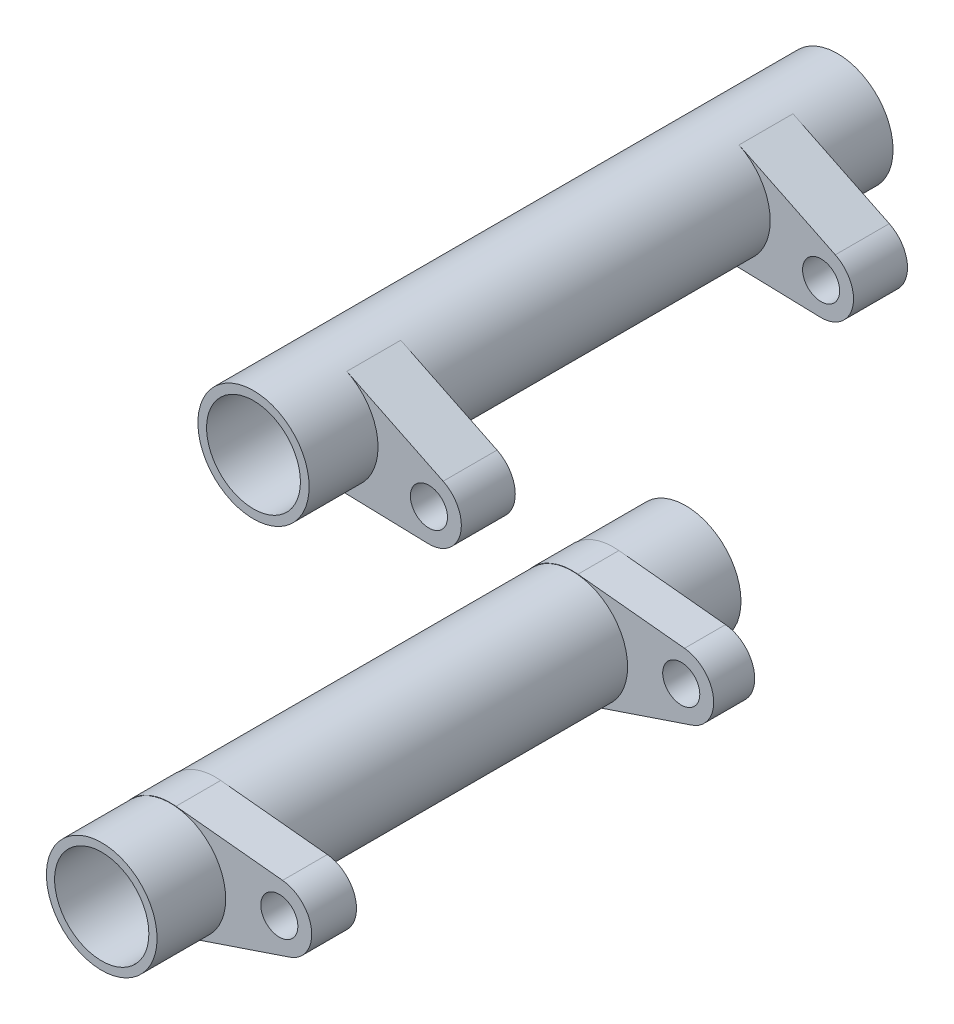
ISO-10303-21;
HEADER;
FILE_DESCRIPTION(('STEP AP214'),'2;1');
FILE_NAME('part.step','',(''),(''),'','','');
FILE_SCHEMA(('AUTOMOTIVE_DESIGN { 1 0 10303 214 1 1 1 1 }'));
ENDSEC;
DATA;
#1=APPLICATION_CONTEXT('core data for automotive mechanical design processes');
#2=APPLICATION_PROTOCOL_DEFINITION('international standard','automotive_design',2000,#1);
#3=PRODUCT_CONTEXT('',#1,'mechanical');
#4=PRODUCT('Part','Part','',(#3));
#5=PRODUCT_RELATED_PRODUCT_CATEGORY('part','',(#4));
#6=PRODUCT_DEFINITION_FORMATION('','',#4);
#7=PRODUCT_DEFINITION_CONTEXT('part definition',#1,'design');
#8=PRODUCT_DEFINITION('design','',#6,#7);
#9=PRODUCT_DEFINITION_SHAPE('','',#8);
#10=(LENGTH_UNIT() NAMED_UNIT(*) SI_UNIT(.MILLI.,.METRE.));
#11=(NAMED_UNIT(*) PLANE_ANGLE_UNIT() SI_UNIT($,.RADIAN.));
#12=(NAMED_UNIT(*) SI_UNIT($,.STERADIAN.) SOLID_ANGLE_UNIT());
#13=UNCERTAINTY_MEASURE_WITH_UNIT(LENGTH_MEASURE(1.E-05),#10,'distance_accuracy_value','');
#14=(GEOMETRIC_REPRESENTATION_CONTEXT(3) GLOBAL_UNCERTAINTY_ASSIGNED_CONTEXT((#13)) GLOBAL_UNIT_ASSIGNED_CONTEXT((#10,
#11,#12)) REPRESENTATION_CONTEXT('',''));
#15=CARTESIAN_POINT('',(0.,0.,0.));
#16=DIRECTION('',(0.,0.,1.));
#17=DIRECTION('',(1.,0.,0.));
#18=AXIS2_PLACEMENT_3D('',#15,#16,#17);
#19=CARTESIAN_POINT('',(11.1153896346749,-25.5193172681576,-25.));
#20=DIRECTION('',(0.,0.,1.));
#21=DIRECTION('',(1.,0.,0.));
#22=AXIS2_PLACEMENT_3D('',#19,#20,#21);
#23=PLANE('',#22);
#24=CARTESIAN_POINT('',(12.996787849316,40.,-25.));
#25=DIRECTION('',(0.,0.,1.));
#26=DIRECTION('',(1.,0.,0.));
#27=AXIS2_PLACEMENT_3D('',#24,#25,#26);
#28=CIRCLE('',#27,4.7625);
#29=CARTESIAN_POINT('',(17.759287849316,40.,-25.));
#30=VERTEX_POINT('',#29);
#31=EDGE_CURVE('E174',#30,#30,#28,.F.);
#32=ORIENTED_EDGE('',*,*,#31,.T.);
#33=EDGE_LOOP('',(#32));
#34=FACE_BOUND('',#33,.T.);
#35=CARTESIAN_POINT('',(12.996787849316,40.,-25.));
#36=DIRECTION('',(0.,0.,1.));
#37=DIRECTION('',(1.,0.,0.));
#38=AXIS2_PLACEMENT_3D('',#35,#36,#37);
#39=CIRCLE('',#38,4.01788211094981);
#40=CARTESIAN_POINT('',(17.0146699602658,40.,-25.));
#41=VERTEX_POINT('',#40);
#42=EDGE_CURVE('E121',#41,#41,#39,.F.);
#43=ORIENTED_EDGE('',*,*,#42,.F.);
#44=EDGE_LOOP('',(#43));
#45=FACE_BOUND('',#44,.T.);
#46=ADVANCED_FACE('F44',(#34,#45),#23,.F.);
#47=CARTESIAN_POINT('',(11.1153896346749,-25.5193172681576,25.));
#48=DIRECTION('',(0.,0.,1.));
#49=DIRECTION('',(1.,0.,0.));
#50=AXIS2_PLACEMENT_3D('',#47,#48,#49);
#51=PLANE('',#50);
#52=CARTESIAN_POINT('',(12.996787849316,40.,25.));
#53=DIRECTION('',(0.,0.,1.));
#54=DIRECTION('',(1.,0.,0.));
#55=AXIS2_PLACEMENT_3D('',#52,#53,#54);
#56=CIRCLE('',#55,4.7625);
#57=CARTESIAN_POINT('',(17.759287849316,40.,25.));
#58=VERTEX_POINT('',#57);
#59=EDGE_CURVE('E172',#58,#58,#56,.F.);
#60=ORIENTED_EDGE('',*,*,#59,.F.);
#61=EDGE_LOOP('',(#60));
#62=FACE_BOUND('',#61,.T.);
#63=CARTESIAN_POINT('',(12.996787849316,40.,25.));
#64=DIRECTION('',(0.,0.,1.));
#65=DIRECTION('',(1.,0.,0.));
#66=AXIS2_PLACEMENT_3D('',#63,#64,#65);
#67=CIRCLE('',#66,4.01788211094981);
#68=CARTESIAN_POINT('',(17.0146699602658,40.,25.));
#69=VERTEX_POINT('',#68);
#70=EDGE_CURVE('E48',#69,#69,#67,.F.);
#71=ORIENTED_EDGE('',*,*,#70,.T.);
#72=EDGE_LOOP('',(#71));
#73=FACE_BOUND('',#72,.T.);
#74=ADVANCED_FACE('F235',(#62,#73),#51,.T.);
#75=CARTESIAN_POINT('',(12.7834911237825,35.2415613479645,-25.));
#76=DIRECTION('',(0.0274432045844318,0.999623364333856,0.));
#77=DIRECTION('',(-0.999623364333856,0.0274432045844318,0.));
#78=AXIS2_PLACEMENT_3D('',#75,#76,#77);
#79=PLANE('',#78);
#80=DIRECTION('',(-0.999623364333856,0.0274432045844318,0.));
#81=VECTOR('',#80,1.);
#82=CARTESIAN_POINT('',(12.7834911237825,35.2415613479645,-19.1050146043242));
#83=LINE('',#82,#81);
#84=CARTESIAN_POINT('',(22.0403735474453,34.9874271137813,-19.1050146043242));
#85=VERTEX_POINT('',#84);
#86=CARTESIAN_POINT('',(12.8660895874826,35.23929372736,-19.1050146043242));
#87=VERTEX_POINT('',#86);
#88=EDGE_CURVE('E116',#85,#87,#83,.T.);
#89=ORIENTED_EDGE('',*,*,#88,.F.);
#90=DIRECTION('',(0.,0.,1.));
#91=VECTOR('',#90,1.);
#92=CARTESIAN_POINT('',(22.0403735474453,34.9874271137813,-25.));
#93=LINE('',#92,#91);
#94=CARTESIAN_POINT('',(22.0403735474453,34.9874271137813,-14.4815024014905));
#95=VERTEX_POINT('',#94);
#96=EDGE_CURVE('E60',#85,#95,#93,.T.);
#97=ORIENTED_EDGE('',*,*,#96,.T.);
#98=DIRECTION('',(0.999623364333856,-0.0274432045844318,0.));
#99=VECTOR('',#98,1.);
#100=CARTESIAN_POINT('',(12.7834911237825,35.2415613479645,-14.4815024014905));
#101=LINE('',#100,#99);
#102=CARTESIAN_POINT('',(12.8660895874826,35.23929372736,-14.4815024014905));
#103=VERTEX_POINT('',#102);
#104=EDGE_CURVE('E155',#103,#95,#101,.T.);
#105=ORIENTED_EDGE('',*,*,#104,.F.);
#106=DIRECTION('',(0.,0.,1.));
#107=VECTOR('',#106,1.);
#108=CARTESIAN_POINT('',(12.8660895874826,35.23929372736,-25.));
#109=LINE('',#108,#107);
#110=EDGE_CURVE('E140',#87,#103,#109,.T.);
#111=ORIENTED_EDGE('',*,*,#110,.F.);
#112=EDGE_LOOP('',(#89,#97,#105,#111));
#113=FACE_BOUND('',#112,.T.);
#114=ADVANCED_FACE('F159',(#113),#79,.F.);
#115=CARTESIAN_POINT('',(39.3776963013043,32.4332073665564,-25.));
#116=DIRECTION('',(-0.438333206174776,-0.898812550181928,0.));
#117=DIRECTION('',(0.898812550181928,-0.438333206174776,0.));
#118=AXIS2_PLACEMENT_3D('',#115,#116,#117);
#119=PLANE('',#118);
#120=DIRECTION('',(0.898812550181928,-0.438333206174776,0.));
#121=VECTOR('',#120,1.);
#122=CARTESIAN_POINT('',(39.3776963013043,32.4332073665564,-19.1050146043242));
#123=LINE('',#122,#121);
#124=CARTESIAN_POINT('',(15.0843497437233,44.2805947702414,-19.1050146043242));
#125=VERTEX_POINT('',#124);
#126=CARTESIAN_POINT('',(23.3334181992634,40.2576862969005,-19.1050146043242));
#127=VERTEX_POINT('',#126);
#128=EDGE_CURVE('E114',#125,#127,#123,.T.);
#129=ORIENTED_EDGE('',*,*,#128,.F.);
#130=DIRECTION('',(0.,0.,1.));
#131=VECTOR('',#130,1.);
#132=CARTESIAN_POINT('',(15.0843497437233,44.2805947702414,-25.));
#133=LINE('',#132,#131);
#134=CARTESIAN_POINT('',(15.0843497437234,44.2805947702414,-14.4815024014905));
#135=VERTEX_POINT('',#134);
#136=EDGE_CURVE('E127',#125,#135,#133,.T.);
#137=ORIENTED_EDGE('',*,*,#136,.T.);
#138=DIRECTION('',(-0.898812550181928,0.438333206174776,0.));
#139=VECTOR('',#138,1.);
#140=CARTESIAN_POINT('',(39.3776963013043,32.4332073665564,-14.4815024014905));
#141=LINE('',#140,#139);
#142=CARTESIAN_POINT('',(23.3334181992634,40.2576862969005,-14.4815024014905));
#143=VERTEX_POINT('',#142);
#144=EDGE_CURVE('E156',#143,#135,#141,.T.);
#145=ORIENTED_EDGE('',*,*,#144,.F.);
#146=DIRECTION('',(0.,0.,1.));
#147=VECTOR('',#146,1.);
#148=CARTESIAN_POINT('',(23.3334181992634,40.2576862969005,-25.));
#149=LINE('',#148,#147);
#150=EDGE_CURVE('E129',#127,#143,#149,.T.);
#151=ORIENTED_EDGE('',*,*,#150,.F.);
#152=EDGE_LOOP('',(#129,#137,#145,#151));
#153=FACE_BOUND('',#152,.T.);
#154=ADVANCED_FACE('F125',(#153),#119,.F.);
#155=CARTESIAN_POINT('',(22.1165587901862,37.76248745438,-25.));
#156=DIRECTION('',(0.,0.,1.));
#157=DIRECTION('',(1.,0.,0.));
#158=AXIS2_PLACEMENT_3D('',#155,#156,#157);
#159=CYLINDRICAL_SURFACE('',#158,1.58750000000001);
#160=CARTESIAN_POINT('',(22.1165587901862,37.76248745438,-14.4815024014905));
#161=DIRECTION('',(0.,0.,1.));
#162=DIRECTION('',(1.,0.,0.));
#163=AXIS2_PLACEMENT_3D('',#160,#161,#162);
#164=CIRCLE('',#163,1.58750000000001);
#165=CARTESIAN_POINT('',(23.7040587901862,37.76248745438,-14.4815024014905));
#166=VERTEX_POINT('',#165);
#167=EDGE_CURVE('E160',#166,#166,#164,.F.);
#168=ORIENTED_EDGE('',*,*,#167,.F.);
#169=EDGE_LOOP('',(#168));
#170=FACE_BOUND('',#169,.T.);
#171=CARTESIAN_POINT('',(22.1165587901862,37.76248745438,-19.1050146043242));
#172=DIRECTION('',(0.,0.,-1.));
#173=DIRECTION('',(-1.,0.,0.));
#174=AXIS2_PLACEMENT_3D('',#171,#172,#173);
#175=CIRCLE('',#174,1.58750000000001);
#176=CARTESIAN_POINT('',(20.5290587901861,37.76248745438,-19.1050146043242));
#177=VERTEX_POINT('',#176);
#178=EDGE_CURVE('E199',#177,#177,#175,.F.);
#179=ORIENTED_EDGE('',*,*,#178,.F.);
#180=EDGE_LOOP('',(#179));
#181=FACE_BOUND('',#180,.T.);
#182=ADVANCED_FACE('F223',(#170,#181),#159,.F.);
#183=CARTESIAN_POINT('',(22.1165587901862,37.76248745438,-25.));
#184=DIRECTION('',(0.,0.,1.));
#185=DIRECTION('',(1.,0.,0.));
#186=AXIS2_PLACEMENT_3D('',#183,#184,#185);
#187=CYLINDRICAL_SURFACE('',#186,2.77610592110159);
#188=ORIENTED_EDGE('',*,*,#96,.F.);
#189=CARTESIAN_POINT('',(22.1165587901862,37.76248745438,-19.1050146043242));
#190=DIRECTION('',(0.,0.,-1.));
#191=DIRECTION('',(-1.,0.,0.));
#192=AXIS2_PLACEMENT_3D('',#189,#190,#191);
#193=CIRCLE('',#192,2.77610592110159);
#194=EDGE_CURVE('E120',#85,#127,#193,.F.);
#195=ORIENTED_EDGE('',*,*,#194,.T.);
#196=ORIENTED_EDGE('',*,*,#150,.T.);
#197=CARTESIAN_POINT('',(22.1165587901862,37.76248745438,-14.4815024014905));
#198=DIRECTION('',(0.,0.,1.));
#199=DIRECTION('',(1.,0.,0.));
#200=AXIS2_PLACEMENT_3D('',#197,#198,#199);
#201=CIRCLE('',#200,2.77610592110159);
#202=EDGE_CURVE('E53',#143,#95,#201,.F.);
#203=ORIENTED_EDGE('',*,*,#202,.T.);
#204=EDGE_LOOP('',(#188,#195,#196,#203));
#205=FACE_BOUND('',#204,.T.);
#206=ADVANCED_FACE('F229',(#205),#187,.T.);
#207=DIRECTION('',(0.999623364333856,-0.0274432045844318,0.));
#208=VECTOR('',#207,1.);
#209=CARTESIAN_POINT('',(12.7834911237825,35.2415613479645,19.09964848979));
#210=LINE('',#209,#208);
#211=CARTESIAN_POINT('',(12.8660895874826,35.23929372736,19.09964848979));
#212=VERTEX_POINT('',#211);
#213=CARTESIAN_POINT('',(22.0403735474453,34.9874271137813,19.09964848979));
#214=VERTEX_POINT('',#213);
#215=EDGE_CURVE('E185',#212,#214,#210,.T.);
#216=ORIENTED_EDGE('',*,*,#215,.F.);
#217=CARTESIAN_POINT('',(12.8660895874826,35.23929372736,14.4815024014905));
#218=VERTEX_POINT('',#217);
#219=EDGE_CURVE('E136',#218,#212,#109,.T.);
#220=ORIENTED_EDGE('',*,*,#219,.F.);
#221=DIRECTION('',(-0.999623364333856,0.0274432045844318,0.));
#222=VECTOR('',#221,1.);
#223=CARTESIAN_POINT('',(12.7834911237825,35.2415613479645,14.4815024014905));
#224=LINE('',#223,#222);
#225=CARTESIAN_POINT('',(22.0403735474453,34.9874271137813,14.4815024014905));
#226=VERTEX_POINT('',#225);
#227=EDGE_CURVE('E167',#226,#218,#224,.T.);
#228=ORIENTED_EDGE('',*,*,#227,.F.);
#229=EDGE_CURVE('E148',#226,#214,#93,.T.);
#230=ORIENTED_EDGE('',*,*,#229,.T.);
#231=EDGE_LOOP('',(#216,#220,#228,#230));
#232=FACE_BOUND('',#231,.T.);
#233=ADVANCED_FACE('F183',(#232),#79,.F.);
#234=DIRECTION('',(-0.898812550181928,0.438333206174776,0.));
#235=VECTOR('',#234,1.);
#236=CARTESIAN_POINT('',(39.3776963013043,32.4332073665564,19.09964848979));
#237=LINE('',#236,#235);
#238=CARTESIAN_POINT('',(23.3334181992634,40.2576862969005,19.09964848979));
#239=VERTEX_POINT('',#238);
#240=CARTESIAN_POINT('',(15.0843497437233,44.2805947702414,19.09964848979));
#241=VERTEX_POINT('',#240);
#242=EDGE_CURVE('E194',#239,#241,#237,.T.);
#243=ORIENTED_EDGE('',*,*,#242,.F.);
#244=CARTESIAN_POINT('',(23.3334181992634,40.2576862969005,14.4815024014905));
#245=VERTEX_POINT('',#244);
#246=EDGE_CURVE('E146',#245,#239,#149,.T.);
#247=ORIENTED_EDGE('',*,*,#246,.F.);
#248=DIRECTION('',(0.898812550181928,-0.438333206174776,0.));
#249=VECTOR('',#248,1.);
#250=CARTESIAN_POINT('',(39.3776963013043,32.4332073665564,14.4815024014905));
#251=LINE('',#250,#249);
#252=CARTESIAN_POINT('',(15.0843497437234,44.2805947702414,14.4815024014905));
#253=VERTEX_POINT('',#252);
#254=EDGE_CURVE('E68',#253,#245,#251,.T.);
#255=ORIENTED_EDGE('',*,*,#254,.F.);
#256=EDGE_CURVE('E137',#253,#241,#133,.T.);
#257=ORIENTED_EDGE('',*,*,#256,.T.);
#258=EDGE_LOOP('',(#243,#247,#255,#257));
#259=FACE_BOUND('',#258,.T.);
#260=ADVANCED_FACE('F213',(#259),#119,.F.);
#261=CARTESIAN_POINT('',(22.1165587901862,37.76248745438,14.4815024014905));
#262=DIRECTION('',(0.,0.,-1.));
#263=DIRECTION('',(-1.,0.,0.));
#264=AXIS2_PLACEMENT_3D('',#261,#262,#263);
#265=CIRCLE('',#264,1.58750000000001);
#266=CARTESIAN_POINT('',(20.5290587901861,37.76248745438,14.4815024014905));
#267=VERTEX_POINT('',#266);
#268=EDGE_CURVE('E169',#267,#267,#265,.F.);
#269=ORIENTED_EDGE('',*,*,#268,.F.);
#270=EDGE_LOOP('',(#269));
#271=FACE_BOUND('',#270,.T.);
#272=CARTESIAN_POINT('',(22.1165587901862,37.76248745438,19.09964848979));
#273=DIRECTION('',(0.,0.,1.));
#274=DIRECTION('',(1.,0.,0.));
#275=AXIS2_PLACEMENT_3D('',#272,#273,#274);
#276=CIRCLE('',#275,1.58750000000001);
#277=CARTESIAN_POINT('',(23.7040587901862,37.76248745438,19.09964848979));
#278=VERTEX_POINT('',#277);
#279=EDGE_CURVE('E204',#278,#278,#276,.F.);
#280=ORIENTED_EDGE('',*,*,#279,.F.);
#281=EDGE_LOOP('',(#280));
#282=FACE_BOUND('',#281,.T.);
#283=ADVANCED_FACE('F46',(#271,#282),#159,.F.);
#284=ORIENTED_EDGE('',*,*,#246,.T.);
#285=CARTESIAN_POINT('',(22.1165587901862,37.76248745438,19.09964848979));
#286=DIRECTION('',(0.,0.,1.));
#287=DIRECTION('',(1.,0.,0.));
#288=AXIS2_PLACEMENT_3D('',#285,#286,#287);
#289=CIRCLE('',#288,2.77610592110159);
#290=EDGE_CURVE('E191',#239,#214,#289,.F.);
#291=ORIENTED_EDGE('',*,*,#290,.T.);
#292=ORIENTED_EDGE('',*,*,#229,.F.);
#293=CARTESIAN_POINT('',(22.1165587901862,37.76248745438,14.4815024014905));
#294=DIRECTION('',(0.,0.,-1.));
#295=DIRECTION('',(-1.,0.,0.));
#296=AXIS2_PLACEMENT_3D('',#293,#294,#295);
#297=CIRCLE('',#296,2.77610592110159);
#298=EDGE_CURVE('E12',#226,#245,#297,.F.);
#299=ORIENTED_EDGE('',*,*,#298,.T.);
#300=EDGE_LOOP('',(#284,#291,#292,#299));
#301=FACE_BOUND('',#300,.T.);
#302=ADVANCED_FACE('F189',(#301),#187,.T.);
#303=CARTESIAN_POINT('',(12.996787849316,40.,-25.));
#304=DIRECTION('',(0.,0.,1.));
#305=DIRECTION('',(1.,0.,0.));
#306=AXIS2_PLACEMENT_3D('',#303,#304,#305);
#307=CYLINDRICAL_SURFACE('',#306,4.7625);
#308=CARTESIAN_POINT('',(12.996787849316,40.,-19.1050146043242));
#309=DIRECTION('',(0.,0.,1.));
#310=DIRECTION('',(1.,0.,0.));
#311=AXIS2_PLACEMENT_3D('',#308,#309,#310);
#312=CIRCLE('',#311,4.76250000000001);
#313=EDGE_CURVE('E110',#87,#125,#312,.T.);
#314=ORIENTED_EDGE('',*,*,#313,.F.);
#315=ORIENTED_EDGE('',*,*,#110,.T.);
#316=CARTESIAN_POINT('',(12.996787849316,40.,-14.4815024014905));
#317=DIRECTION('',(0.,0.,1.));
#318=DIRECTION('',(1.,0.,0.));
#319=AXIS2_PLACEMENT_3D('',#316,#317,#318);
#320=CIRCLE('',#319,4.76250000000001);
#321=EDGE_CURVE('E135',#103,#135,#320,.T.);
#322=ORIENTED_EDGE('',*,*,#321,.T.);
#323=ORIENTED_EDGE('',*,*,#136,.F.);
#324=EDGE_LOOP('',(#314,#315,#322,#323));
#325=FACE_BOUND('',#324,.T.);
#326=ORIENTED_EDGE('',*,*,#31,.F.);
#327=EDGE_LOOP('',(#326));
#328=FACE_BOUND('',#327,.T.);
#329=ORIENTED_EDGE('',*,*,#219,.T.);
#330=CARTESIAN_POINT('',(12.996787849316,40.,19.09964848979));
#331=DIRECTION('',(0.,0.,1.));
#332=DIRECTION('',(1.,0.,0.));
#333=AXIS2_PLACEMENT_3D('',#330,#331,#332);
#334=CIRCLE('',#333,4.76250000000001);
#335=EDGE_CURVE('E195',#212,#241,#334,.T.);
#336=ORIENTED_EDGE('',*,*,#335,.T.);
#337=ORIENTED_EDGE('',*,*,#256,.F.);
#338=CARTESIAN_POINT('',(12.996787849316,40.,14.4815024014905));
#339=DIRECTION('',(0.,0.,1.));
#340=DIRECTION('',(1.,0.,0.));
#341=AXIS2_PLACEMENT_3D('',#338,#339,#340);
#342=CIRCLE('',#341,4.76250000000001);
#343=EDGE_CURVE('E157',#218,#253,#342,.T.);
#344=ORIENTED_EDGE('',*,*,#343,.F.);
#345=EDGE_LOOP('',(#329,#336,#337,#344));
#346=FACE_BOUND('',#345,.T.);
#347=ORIENTED_EDGE('',*,*,#59,.T.);
#348=EDGE_LOOP('',(#347));
#349=FACE_BOUND('',#348,.T.);
#350=ADVANCED_FACE('F132',(#325,#328,#346,#349),#307,.T.);
#351=CARTESIAN_POINT('',(12.996787849316,59.4717137736207,14.4815024014905));
#352=DIRECTION('',(0.,0.,-1.));
#353=DIRECTION('',(-1.,0.,0.));
#354=AXIS2_PLACEMENT_3D('',#351,#352,#353);
#355=PLANE('',#354);
#356=ORIENTED_EDGE('',*,*,#227,.T.);
#357=ORIENTED_EDGE('',*,*,#343,.T.);
#358=ORIENTED_EDGE('',*,*,#254,.T.);
#359=ORIENTED_EDGE('',*,*,#298,.F.);
#360=EDGE_LOOP('',(#356,#357,#358,#359));
#361=FACE_BOUND('',#360,.T.);
#362=ORIENTED_EDGE('',*,*,#268,.T.);
#363=EDGE_LOOP('',(#362));
#364=FACE_BOUND('',#363,.T.);
#365=ADVANCED_FACE('F208',(#361,#364),#355,.T.);
#366=CARTESIAN_POINT('',(12.996787849316,59.4717137736207,-14.4815024014905));
#367=DIRECTION('',(0.,0.,1.));
#368=DIRECTION('',(1.,0.,0.));
#369=AXIS2_PLACEMENT_3D('',#366,#367,#368);
#370=PLANE('',#369);
#371=ORIENTED_EDGE('',*,*,#104,.T.);
#372=ORIENTED_EDGE('',*,*,#202,.F.);
#373=ORIENTED_EDGE('',*,*,#144,.T.);
#374=ORIENTED_EDGE('',*,*,#321,.F.);
#375=EDGE_LOOP('',(#371,#372,#373,#374));
#376=FACE_BOUND('',#375,.T.);
#377=ORIENTED_EDGE('',*,*,#167,.T.);
#378=EDGE_LOOP('',(#377));
#379=FACE_BOUND('',#378,.T.);
#380=ADVANCED_FACE('F153',(#376,#379),#370,.T.);
#381=CARTESIAN_POINT('',(12.996787849316,59.4717137736207,19.09964848979));
#382=DIRECTION('',(0.,0.,1.));
#383=DIRECTION('',(1.,0.,0.));
#384=AXIS2_PLACEMENT_3D('',#381,#382,#383);
#385=PLANE('',#384);
#386=ORIENTED_EDGE('',*,*,#215,.T.);
#387=ORIENTED_EDGE('',*,*,#290,.F.);
#388=ORIENTED_EDGE('',*,*,#242,.T.);
#389=ORIENTED_EDGE('',*,*,#335,.F.);
#390=EDGE_LOOP('',(#386,#387,#388,#389));
#391=FACE_BOUND('',#390,.T.);
#392=ORIENTED_EDGE('',*,*,#279,.T.);
#393=EDGE_LOOP('',(#392));
#394=FACE_BOUND('',#393,.T.);
#395=ADVANCED_FACE('F215',(#391,#394),#385,.T.);
#396=CARTESIAN_POINT('',(12.996787849316,59.4717137736207,-19.1050146043242));
#397=DIRECTION('',(0.,0.,-1.));
#398=DIRECTION('',(-1.,0.,0.));
#399=AXIS2_PLACEMENT_3D('',#396,#397,#398);
#400=PLANE('',#399);
#401=ORIENTED_EDGE('',*,*,#88,.T.);
#402=ORIENTED_EDGE('',*,*,#313,.T.);
#403=ORIENTED_EDGE('',*,*,#128,.T.);
#404=ORIENTED_EDGE('',*,*,#194,.F.);
#405=EDGE_LOOP('',(#401,#402,#403,#404));
#406=FACE_BOUND('',#405,.T.);
#407=ORIENTED_EDGE('',*,*,#178,.T.);
#408=EDGE_LOOP('',(#407));
#409=FACE_BOUND('',#408,.T.);
#410=ADVANCED_FACE('F112',(#406,#409),#400,.T.);
#411=CARTESIAN_POINT('',(12.996787849316,40.,0.));
#412=DIRECTION('',(0.,0.,1.));
#413=DIRECTION('',(1.,0.,0.));
#414=AXIS2_PLACEMENT_3D('',#411,#412,#413);
#415=CYLINDRICAL_SURFACE('',#414,4.01788211094981);
#416=ORIENTED_EDGE('',*,*,#70,.F.);
#417=EDGE_LOOP('',(#416));
#418=FACE_BOUND('',#417,.T.);
#419=ORIENTED_EDGE('',*,*,#42,.T.);
#420=EDGE_LOOP('',(#419));
#421=FACE_BOUND('',#420,.T.);
#422=ADVANCED_FACE('F322',(#418,#421),#415,.F.);
#423=CLOSED_SHELL('',(#46,#74,#114,#154,#182,#206,#233,#260,#283,#302,#350,#365,#380,#395,#410,#422));
#424=MANIFOLD_SOLID_BREP('B2',#423);
#425=CARTESIAN_POINT('',(11.1153896346749,-25.5193172681576,25.));
#426=DIRECTION('',(0.,0.,1.));
#427=DIRECTION('',(1.,0.,0.));
#428=AXIS2_PLACEMENT_3D('',#425,#426,#427);
#429=PLANE('',#428);
#430=CARTESIAN_POINT('',(0.,0.,25.));
#431=DIRECTION('',(0.,0.,1.));
#432=DIRECTION('',(1.,0.,0.));
#433=AXIS2_PLACEMENT_3D('',#430,#431,#432);
#434=CIRCLE('',#433,4.7381854791324);
#435=CARTESIAN_POINT('',(4.7381854791324,0.,25.));
#436=VERTEX_POINT('',#435);
#437=EDGE_CURVE('E495',#436,#436,#434,.T.);
#438=ORIENTED_EDGE('',*,*,#437,.T.);
#439=EDGE_LOOP('',(#438));
#440=FACE_BOUND('',#439,.T.);
#441=CARTESIAN_POINT('',(0.,0.,25.));
#442=DIRECTION('',(0.,0.,1.));
#443=DIRECTION('',(1.,0.,0.));
#444=AXIS2_PLACEMENT_3D('',#441,#442,#443);
#445=CIRCLE('',#444,4.03498995766331);
#446=CARTESIAN_POINT('',(4.03498995766331,0.,25.));
#447=VERTEX_POINT('',#446);
#448=EDGE_CURVE('E623',#447,#447,#445,.F.);
#449=ORIENTED_EDGE('',*,*,#448,.T.);
#450=EDGE_LOOP('',(#449));
#451=FACE_BOUND('',#450,.T.);
#452=ADVANCED_FACE('F376',(#440,#451),#429,.T.);
#453=CARTESIAN_POINT('',(11.1153896346749,-25.5193172681576,-25.));
#454=DIRECTION('',(0.,0.,1.));
#455=DIRECTION('',(1.,0.,0.));
#456=AXIS2_PLACEMENT_3D('',#453,#454,#455);
#457=PLANE('',#456);
#458=CARTESIAN_POINT('',(0.,0.,-25.));
#459=DIRECTION('',(0.,0.,1.));
#460=DIRECTION('',(1.,0.,0.));
#461=AXIS2_PLACEMENT_3D('',#458,#459,#460);
#462=CIRCLE('',#461,4.7381854791324);
#463=CARTESIAN_POINT('',(4.7381854791324,0.,-25.));
#464=VERTEX_POINT('',#463);
#465=EDGE_CURVE('E505',#464,#464,#462,.T.);
#466=ORIENTED_EDGE('',*,*,#465,.F.);
#467=EDGE_LOOP('',(#466));
#468=FACE_BOUND('',#467,.T.);
#469=CARTESIAN_POINT('',(0.,0.,-25.));
#470=DIRECTION('',(0.,0.,1.));
#471=DIRECTION('',(1.,0.,0.));
#472=AXIS2_PLACEMENT_3D('',#469,#470,#471);
#473=CIRCLE('',#472,4.03498995766331);
#474=CARTESIAN_POINT('',(4.03498995766331,0.,-25.));
#475=VERTEX_POINT('',#474);
#476=EDGE_CURVE('E380',#475,#475,#473,.F.);
#477=ORIENTED_EDGE('',*,*,#476,.F.);
#478=EDGE_LOOP('',(#477));
#479=FACE_BOUND('',#478,.T.);
#480=ADVANCED_FACE('F535',(#468,#479),#457,.F.);
#481=CARTESIAN_POINT('',(14.0450612375706,3.36224426730434,-25.));
#482=DIRECTION('',(-0.100919558005413,-0.994894588794206,0.));
#483=DIRECTION('',(0.994894588794206,-0.100919558005413,0.));
#484=AXIS2_PLACEMENT_3D('',#481,#482,#483);
#485=PLANE('',#484);
#486=DIRECTION('',(0.994894588794206,-0.100919558005413,0.));
#487=VECTOR('',#486,1.);
#488=CARTESIAN_POINT('',(14.0450612375706,3.36224426730434,-18.8055596207821));
#489=LINE('',#488,#487);
#490=CARTESIAN_POINT('',(0.48062939500078,4.7381854791324,-18.8055596207821));
#491=VERTEX_POINT('',#490);
#492=CARTESIAN_POINT('',(9.61151387958948,3.81197195182797,-18.8055596207821));
#493=VERTEX_POINT('',#492);
#494=EDGE_CURVE('E393',#491,#493,#489,.T.);
#495=ORIENTED_EDGE('',*,*,#494,.F.);
#496=DIRECTION('',(0.,0.,1.));
#497=VECTOR('',#496,1.);
#498=CARTESIAN_POINT('',(0.48062939500078,4.7381854791324,-25.));
#499=LINE('',#498,#497);
#500=CARTESIAN_POINT('',(0.480629395000782,4.7381854791324,-15.2925173192102));
#501=VERTEX_POINT('',#500);
#502=EDGE_CURVE('E486',#491,#501,#499,.T.);
#503=ORIENTED_EDGE('',*,*,#502,.T.);
#504=DIRECTION('',(-0.994894588794206,0.100919558005413,0.));
#505=VECTOR('',#504,1.);
#506=CARTESIAN_POINT('',(14.0450612375706,3.36224426730434,-15.2925173192102));
#507=LINE('',#506,#505);
#508=CARTESIAN_POINT('',(9.61151387958948,3.81197195182797,-15.2925173192102));
#509=VERTEX_POINT('',#508);
#510=EDGE_CURVE('E492',#509,#501,#507,.T.);
#511=ORIENTED_EDGE('',*,*,#510,.F.);
#512=DIRECTION('',(0.,0.,1.));
#513=VECTOR('',#512,1.);
#514=CARTESIAN_POINT('',(9.61151387958948,3.81197195182797,-25.));
#515=LINE('',#514,#513);
#516=EDGE_CURVE('E461',#493,#509,#515,.T.);
#517=ORIENTED_EDGE('',*,*,#516,.F.);
#518=EDGE_LOOP('',(#495,#503,#511,#517));
#519=FACE_BOUND('',#518,.T.);
#520=ADVANCED_FACE('F533',(#519),#485,.F.);
#521=CARTESIAN_POINT('',(0.,0.,-25.));
#522=DIRECTION('',(0.,0.,1.));
#523=DIRECTION('',(1.,0.,0.));
#524=AXIS2_PLACEMENT_3D('',#521,#522,#523);
#525=CYLINDRICAL_SURFACE('',#524,4.7625);
#526=ORIENTED_EDGE('',*,*,#502,.F.);
#527=CARTESIAN_POINT('',(0.,0.,-18.8055596207821));
#528=DIRECTION('',(0.,0.,-1.));
#529=DIRECTION('',(-1.,0.,0.));
#530=AXIS2_PLACEMENT_3D('',#527,#528,#529);
#531=CIRCLE('',#530,4.7625);
#532=CARTESIAN_POINT('',(1.5216336606048,-4.51287461081232,-18.8055596207821));
#533=VERTEX_POINT('',#532);
#534=EDGE_CURVE('E455',#491,#533,#531,.F.);
#535=ORIENTED_EDGE('',*,*,#534,.T.);
#536=DIRECTION('',(0.,0.,1.));
#537=VECTOR('',#536,1.);
#538=CARTESIAN_POINT('',(1.5216336606048,-4.51287461081232,-25.));
#539=LINE('',#538,#537);
#540=CARTESIAN_POINT('',(1.5216336606048,-4.51287461081232,-15.2925173192102));
#541=VERTEX_POINT('',#540);
#542=EDGE_CURVE('E454',#533,#541,#539,.T.);
#543=ORIENTED_EDGE('',*,*,#542,.T.);
#544=CARTESIAN_POINT('',(0.,0.,-15.2925173192102));
#545=DIRECTION('',(0.,0.,1.));
#546=DIRECTION('',(1.,0.,0.));
#547=AXIS2_PLACEMENT_3D('',#544,#545,#546);
#548=CIRCLE('',#547,4.7625);
#549=EDGE_CURVE('E471',#541,#501,#548,.F.);
#550=ORIENTED_EDGE('',*,*,#549,.T.);
#551=EDGE_LOOP('',(#526,#535,#543,#550));
#552=FACE_BOUND('',#551,.T.);
#553=ADVANCED_FACE('F530',(#552),#525,.T.);
#554=CARTESIAN_POINT('',(3.77620154118333,-3.7526881059652,-25.));
#555=DIRECTION('',(-0.319503130835654,0.947585220118072,0.));
#556=DIRECTION('',(-0.947585220118072,-0.319503130835654,0.));
#557=AXIS2_PLACEMENT_3D('',#554,#555,#556);
#558=PLANE('',#557);
#559=DIRECTION('',(-0.947585220118072,-0.319503130835654,0.));
#560=VECTOR('',#559,1.);
#561=CARTESIAN_POINT('',(3.77620154118333,-3.7526881059652,-18.8055596207821));
#562=LINE('',#561,#560);
#563=CARTESIAN_POINT('',(10.2183250303791,-1.58055774731368,-18.8055596207821));
#564=VERTEX_POINT('',#563);
#565=EDGE_CURVE('E442',#564,#533,#562,.T.);
#566=ORIENTED_EDGE('',*,*,#565,.F.);
#567=DIRECTION('',(0.,0.,1.));
#568=VECTOR('',#567,1.);
#569=CARTESIAN_POINT('',(10.2183250303791,-1.58055774731368,-25.));
#570=LINE('',#569,#568);
#571=CARTESIAN_POINT('',(10.2183250303791,-1.58055774731368,-15.2925173192102));
#572=VERTEX_POINT('',#571);
#573=EDGE_CURVE('E42',#564,#572,#570,.T.);
#574=ORIENTED_EDGE('',*,*,#573,.T.);
#575=DIRECTION('',(0.947585220118072,0.319503130835654,0.));
#576=VECTOR('',#575,1.);
#577=CARTESIAN_POINT('',(3.77620154118333,-3.7526881059652,-15.2925173192102));
#578=LINE('',#577,#576);
#579=EDGE_CURVE('E466',#541,#572,#578,.T.);
#580=ORIENTED_EDGE('',*,*,#579,.F.);
#581=ORIENTED_EDGE('',*,*,#542,.F.);
#582=EDGE_LOOP('',(#566,#574,#580,#581));
#583=FACE_BOUND('',#582,.T.);
#584=ADVANCED_FACE('F451',(#583),#558,.F.);
#585=CARTESIAN_POINT('',(9.3313504970557,1.05003919300445,-25.));
#586=DIRECTION('',(0.,0.,1.));
#587=DIRECTION('',(1.,0.,0.));
#588=AXIS2_PLACEMENT_3D('',#585,#586,#587);
#589=CYLINDRICAL_SURFACE('',#588,2.77610592110159);
#590=CARTESIAN_POINT('',(9.3313504970557,1.05003919300445,-18.8055596207821));
#591=DIRECTION('',(0.,0.,-1.));
#592=DIRECTION('',(-1.,0.,0.));
#593=AXIS2_PLACEMENT_3D('',#590,#591,#592);
#594=CIRCLE('',#593,2.77610592110159);
#595=EDGE_CURVE('E439',#493,#564,#594,.T.);
#596=ORIENTED_EDGE('',*,*,#595,.F.);
#597=ORIENTED_EDGE('',*,*,#516,.T.);
#598=CARTESIAN_POINT('',(9.3313504970557,1.05003919300445,-15.2925173192102));
#599=DIRECTION('',(0.,0.,1.));
#600=DIRECTION('',(1.,0.,0.));
#601=AXIS2_PLACEMENT_3D('',#598,#599,#600);
#602=CIRCLE('',#601,2.77610592110159);
#603=EDGE_CURVE('E460',#572,#509,#602,.T.);
#604=ORIENTED_EDGE('',*,*,#603,.F.);
#605=ORIENTED_EDGE('',*,*,#573,.F.);
#606=EDGE_LOOP('',(#596,#597,#604,#605));
#607=FACE_BOUND('',#606,.T.);
#608=ADVANCED_FACE('F458',(#607),#589,.T.);
#609=CARTESIAN_POINT('',(9.3313504970557,1.05003919300445,-25.));
#610=DIRECTION('',(0.,0.,1.));
#611=DIRECTION('',(1.,0.,0.));
#612=AXIS2_PLACEMENT_3D('',#609,#610,#611);
#613=CYLINDRICAL_SURFACE('',#612,1.5875);
#614=CARTESIAN_POINT('',(9.3313504970557,1.05003919300445,-15.2925173192102));
#615=DIRECTION('',(0.,0.,1.));
#616=DIRECTION('',(1.,0.,0.));
#617=AXIS2_PLACEMENT_3D('',#614,#615,#616);
#618=CIRCLE('',#617,1.5875);
#619=CARTESIAN_POINT('',(10.9188504970557,1.05003919300445,-15.2925173192102));
#620=VERTEX_POINT('',#619);
#621=EDGE_CURVE('E490',#620,#620,#618,.F.);
#622=ORIENTED_EDGE('',*,*,#621,.F.);
#623=EDGE_LOOP('',(#622));
#624=FACE_BOUND('',#623,.T.);
#625=CARTESIAN_POINT('',(9.3313504970557,1.05003919300445,-18.8055596207821));
#626=DIRECTION('',(0.,0.,-1.));
#627=DIRECTION('',(-1.,0.,0.));
#628=AXIS2_PLACEMENT_3D('',#625,#626,#627);
#629=CIRCLE('',#628,1.5875);
#630=CARTESIAN_POINT('',(7.7438504970557,1.05003919300445,-18.8055596207821));
#631=VERTEX_POINT('',#630);
#632=EDGE_CURVE('E447',#631,#631,#629,.F.);
#633=ORIENTED_EDGE('',*,*,#632,.F.);
#634=EDGE_LOOP('',(#633));
#635=FACE_BOUND('',#634,.T.);
#636=ADVANCED_FACE('F561',(#624,#635),#613,.F.);
#637=CARTESIAN_POINT('',(9.3313504970557,1.05003919300445,19.1255183398619));
#638=DIRECTION('',(0.,0.,1.));
#639=DIRECTION('',(1.,0.,0.));
#640=AXIS2_PLACEMENT_3D('',#637,#638,#639);
#641=CIRCLE('',#640,2.77610592110159);
#642=CARTESIAN_POINT('',(10.2183250303791,-1.58055774731368,19.1255183398619));
#643=VERTEX_POINT('',#642);
#644=CARTESIAN_POINT('',(9.61151387958948,3.81197195182797,19.1255183398619));
#645=VERTEX_POINT('',#644);
#646=EDGE_CURVE('E401',#643,#645,#641,.T.);
#647=ORIENTED_EDGE('',*,*,#646,.F.);
#648=CARTESIAN_POINT('',(10.2183250303791,-1.58055774731368,15.2925173192102));
#649=VERTEX_POINT('',#648);
#650=EDGE_CURVE('E385',#649,#643,#570,.T.);
#651=ORIENTED_EDGE('',*,*,#650,.F.);
#652=CARTESIAN_POINT('',(9.3313504970557,1.05003919300445,15.2925173192102));
#653=DIRECTION('',(0.,0.,-1.));
#654=DIRECTION('',(-1.,0.,0.));
#655=AXIS2_PLACEMENT_3D('',#652,#653,#654);
#656=CIRCLE('',#655,2.77610592110159);
#657=CARTESIAN_POINT('',(9.61151387958948,3.81197195182797,15.2925173192102));
#658=VERTEX_POINT('',#657);
#659=EDGE_CURVE('E481',#658,#649,#656,.T.);
#660=ORIENTED_EDGE('',*,*,#659,.F.);
#661=EDGE_CURVE('E482',#658,#645,#515,.T.);
#662=ORIENTED_EDGE('',*,*,#661,.T.);
#663=EDGE_LOOP('',(#647,#651,#660,#662));
#664=FACE_BOUND('',#663,.T.);
#665=ADVANCED_FACE('F378',(#664),#589,.T.);
#666=DIRECTION('',(0.947585220118072,0.319503130835654,0.));
#667=VECTOR('',#666,1.);
#668=CARTESIAN_POINT('',(3.77620154118333,-3.7526881059652,19.1255183398619));
#669=LINE('',#668,#667);
#670=CARTESIAN_POINT('',(1.5216336606048,-4.51287461081232,19.1255183398619));
#671=VERTEX_POINT('',#670);
#672=EDGE_CURVE('E518',#671,#643,#669,.T.);
#673=ORIENTED_EDGE('',*,*,#672,.F.);
#674=CARTESIAN_POINT('',(1.5216336606048,-4.51287461081232,15.2925173192102));
#675=VERTEX_POINT('',#674);
#676=EDGE_CURVE('E485',#675,#671,#539,.T.);
#677=ORIENTED_EDGE('',*,*,#676,.F.);
#678=DIRECTION('',(-0.947585220118072,-0.319503130835654,0.));
#679=VECTOR('',#678,1.);
#680=CARTESIAN_POINT('',(3.77620154118333,-3.7526881059652,15.2925173192102));
#681=LINE('',#680,#679);
#682=EDGE_CURVE('E479',#649,#675,#681,.T.);
#683=ORIENTED_EDGE('',*,*,#682,.F.);
#684=ORIENTED_EDGE('',*,*,#650,.T.);
#685=EDGE_LOOP('',(#673,#677,#683,#684));
#686=FACE_BOUND('',#685,.T.);
#687=ADVANCED_FACE('F562',(#686),#558,.F.);
#688=ORIENTED_EDGE('',*,*,#676,.T.);
#689=CARTESIAN_POINT('',(0.,0.,19.1255183398619));
#690=DIRECTION('',(0.,0.,1.));
#691=DIRECTION('',(1.,0.,0.));
#692=AXIS2_PLACEMENT_3D('',#689,#690,#691);
#693=CIRCLE('',#692,4.7625);
#694=CARTESIAN_POINT('',(0.480629395000782,4.7381854791324,19.1255183398619));
#695=VERTEX_POINT('',#694);
#696=EDGE_CURVE('E515',#671,#695,#693,.F.);
#697=ORIENTED_EDGE('',*,*,#696,.T.);
#698=CARTESIAN_POINT('',(0.48062939500078,4.7381854791324,15.2925173192102));
#699=VERTEX_POINT('',#698);
#700=EDGE_CURVE('E488',#699,#695,#499,.T.);
#701=ORIENTED_EDGE('',*,*,#700,.F.);
#702=CARTESIAN_POINT('',(0.,0.,15.2925173192102));
#703=DIRECTION('',(0.,0.,-1.));
#704=DIRECTION('',(-1.,0.,0.));
#705=AXIS2_PLACEMENT_3D('',#702,#703,#704);
#706=CIRCLE('',#705,4.7625);
#707=EDGE_CURVE('E476',#699,#675,#706,.F.);
#708=ORIENTED_EDGE('',*,*,#707,.T.);
#709=EDGE_LOOP('',(#688,#697,#701,#708));
#710=FACE_BOUND('',#709,.T.);
#711=ADVANCED_FACE('F542',(#710),#525,.T.);
#712=DIRECTION('',(-0.994894588794206,0.100919558005413,0.));
#713=VECTOR('',#712,1.);
#714=CARTESIAN_POINT('',(14.0450612375706,3.36224426730434,19.1255183398619));
#715=LINE('',#714,#713);
#716=EDGE_CURVE('E502',#645,#695,#715,.T.);
#717=ORIENTED_EDGE('',*,*,#716,.F.);
#718=ORIENTED_EDGE('',*,*,#661,.F.);
#719=DIRECTION('',(0.994894588794206,-0.100919558005413,0.));
#720=VECTOR('',#719,1.);
#721=CARTESIAN_POINT('',(14.0450612375706,3.36224426730434,15.2925173192102));
#722=LINE('',#721,#720);
#723=EDGE_CURVE('E469',#699,#658,#722,.T.);
#724=ORIENTED_EDGE('',*,*,#723,.F.);
#725=ORIENTED_EDGE('',*,*,#700,.T.);
#726=EDGE_LOOP('',(#717,#718,#724,#725));
#727=FACE_BOUND('',#726,.T.);
#728=ADVANCED_FACE('F536',(#727),#485,.F.);
#729=CARTESIAN_POINT('',(9.3313504970557,1.05003919300445,15.2925173192102));
#730=DIRECTION('',(0.,0.,-1.));
#731=DIRECTION('',(-1.,0.,0.));
#732=AXIS2_PLACEMENT_3D('',#729,#730,#731);
#733=CIRCLE('',#732,1.5875);
#734=CARTESIAN_POINT('',(7.7438504970557,1.05003919300445,15.2925173192102));
#735=VERTEX_POINT('',#734);
#736=EDGE_CURVE('E465',#735,#735,#733,.F.);
#737=ORIENTED_EDGE('',*,*,#736,.F.);
#738=EDGE_LOOP('',(#737));
#739=FACE_BOUND('',#738,.T.);
#740=CARTESIAN_POINT('',(9.3313504970557,1.05003919300445,19.1255183398619));
#741=DIRECTION('',(0.,0.,1.));
#742=DIRECTION('',(1.,0.,0.));
#743=AXIS2_PLACEMENT_3D('',#740,#741,#742);
#744=CIRCLE('',#743,1.5875);
#745=CARTESIAN_POINT('',(10.9188504970557,1.05003919300445,19.1255183398619));
#746=VERTEX_POINT('',#745);
#747=EDGE_CURVE('E498',#746,#746,#744,.F.);
#748=ORIENTED_EDGE('',*,*,#747,.F.);
#749=EDGE_LOOP('',(#748));
#750=FACE_BOUND('',#749,.T.);
#751=ADVANCED_FACE('F546',(#739,#750),#613,.F.);
#752=CARTESIAN_POINT('',(0.,14.5489820503315,15.2925173192102));
#753=DIRECTION('',(0.,0.,-1.));
#754=DIRECTION('',(-1.,0.,0.));
#755=AXIS2_PLACEMENT_3D('',#752,#753,#754);
#756=PLANE('',#755);
#757=ORIENTED_EDGE('',*,*,#736,.T.);
#758=EDGE_LOOP('',(#757));
#759=FACE_BOUND('',#758,.T.);
#760=CARTESIAN_POINT('',(0.,0.,15.2925173192102));
#761=DIRECTION('',(0.,0.,1.));
#762=DIRECTION('',(1.,0.,0.));
#763=AXIS2_PLACEMENT_3D('',#760,#761,#762);
#764=CIRCLE('',#763,4.7381854791324);
#765=CARTESIAN_POINT('',(4.7381854791324,0.,15.2925173192102));
#766=VERTEX_POINT('',#765);
#767=EDGE_CURVE('E521',#766,#766,#764,.T.);
#768=ORIENTED_EDGE('',*,*,#767,.T.);
#769=EDGE_LOOP('',(#768));
#770=FACE_BOUND('',#769,.T.);
#771=ORIENTED_EDGE('',*,*,#659,.T.);
#772=ORIENTED_EDGE('',*,*,#682,.T.);
#773=ORIENTED_EDGE('',*,*,#707,.F.);
#774=ORIENTED_EDGE('',*,*,#723,.T.);
#775=EDGE_LOOP('',(#771,#772,#773,#774));
#776=FACE_BOUND('',#775,.T.);
#777=ADVANCED_FACE('F555',(#759,#770,#776),#756,.T.);
#778=CARTESIAN_POINT('',(0.,14.5489820503315,-15.2925173192102));
#779=DIRECTION('',(0.,0.,1.));
#780=DIRECTION('',(1.,0.,0.));
#781=AXIS2_PLACEMENT_3D('',#778,#779,#780);
#782=PLANE('',#781);
#783=ORIENTED_EDGE('',*,*,#621,.T.);
#784=EDGE_LOOP('',(#783));
#785=FACE_BOUND('',#784,.T.);
#786=CARTESIAN_POINT('',(0.,0.,-15.2925173192102));
#787=DIRECTION('',(0.,0.,1.));
#788=DIRECTION('',(1.,0.,0.));
#789=AXIS2_PLACEMENT_3D('',#786,#787,#788);
#790=CIRCLE('',#789,4.7381854791324);
#791=CARTESIAN_POINT('',(4.7381854791324,0.,-15.2925173192102));
#792=VERTEX_POINT('',#791);
#793=EDGE_CURVE('E493',#792,#792,#790,.T.);
#794=ORIENTED_EDGE('',*,*,#793,.F.);
#795=EDGE_LOOP('',(#794));
#796=FACE_BOUND('',#795,.T.);
#797=ORIENTED_EDGE('',*,*,#603,.T.);
#798=ORIENTED_EDGE('',*,*,#510,.T.);
#799=ORIENTED_EDGE('',*,*,#549,.F.);
#800=ORIENTED_EDGE('',*,*,#579,.T.);
#801=EDGE_LOOP('',(#797,#798,#799,#800));
#802=FACE_BOUND('',#801,.T.);
#803=ADVANCED_FACE('F531',(#785,#796,#802),#782,.T.);
#804=CARTESIAN_POINT('',(0.,0.,35.414629517374));
#805=DIRECTION('',(0.,0.,1.));
#806=DIRECTION('',(1.,0.,0.));
#807=AXIS2_PLACEMENT_3D('',#804,#805,#806);
#808=CYLINDRICAL_SURFACE('',#807,4.7381854791324);
#809=ORIENTED_EDGE('',*,*,#793,.T.);
#810=EDGE_LOOP('',(#809));
#811=FACE_BOUND('',#810,.T.);
#812=ORIENTED_EDGE('',*,*,#767,.F.);
#813=EDGE_LOOP('',(#812));
#814=FACE_BOUND('',#813,.T.);
#815=ADVANCED_FACE('F589',(#811,#814),#808,.T.);
#816=CARTESIAN_POINT('',(0.,14.5489820503315,19.1255183398619));
#817=DIRECTION('',(0.,0.,1.));
#818=DIRECTION('',(1.,0.,0.));
#819=AXIS2_PLACEMENT_3D('',#816,#817,#818);
#820=PLANE('',#819);
#821=ORIENTED_EDGE('',*,*,#747,.T.);
#822=EDGE_LOOP('',(#821));
#823=FACE_BOUND('',#822,.T.);
#824=CARTESIAN_POINT('',(0.,0.,19.1255183398619));
#825=DIRECTION('',(0.,0.,1.));
#826=DIRECTION('',(1.,0.,0.));
#827=AXIS2_PLACEMENT_3D('',#824,#825,#826);
#828=CIRCLE('',#827,4.7381854791324);
#829=CARTESIAN_POINT('',(4.7381854791324,0.,19.1255183398619));
#830=VERTEX_POINT('',#829);
#831=EDGE_CURVE('E499',#830,#830,#828,.T.);
#832=ORIENTED_EDGE('',*,*,#831,.F.);
#833=EDGE_LOOP('',(#832));
#834=FACE_BOUND('',#833,.T.);
#835=ORIENTED_EDGE('',*,*,#646,.T.);
#836=ORIENTED_EDGE('',*,*,#716,.T.);
#837=ORIENTED_EDGE('',*,*,#696,.F.);
#838=ORIENTED_EDGE('',*,*,#672,.T.);
#839=EDGE_LOOP('',(#835,#836,#837,#838));
#840=FACE_BOUND('',#839,.T.);
#841=ADVANCED_FACE('F577',(#823,#834,#840),#820,.T.);
#842=CARTESIAN_POINT('',(0.,0.,35.414629517374));
#843=DIRECTION('',(0.,0.,1.));
#844=DIRECTION('',(1.,0.,0.));
#845=AXIS2_PLACEMENT_3D('',#842,#843,#844);
#846=CYLINDRICAL_SURFACE('',#845,4.7381854791324);
#847=ORIENTED_EDGE('',*,*,#437,.F.);
#848=EDGE_LOOP('',(#847));
#849=FACE_BOUND('',#848,.T.);
#850=ORIENTED_EDGE('',*,*,#831,.T.);
#851=EDGE_LOOP('',(#850));
#852=FACE_BOUND('',#851,.T.);
#853=ADVANCED_FACE('F601',(#849,#852),#846,.T.);
#854=CARTESIAN_POINT('',(0.,0.,35.414629517374));
#855=DIRECTION('',(0.,0.,1.));
#856=DIRECTION('',(1.,0.,0.));
#857=AXIS2_PLACEMENT_3D('',#854,#855,#856);
#858=CYLINDRICAL_SURFACE('',#857,4.7381854791324);
#859=CARTESIAN_POINT('',(0.,0.,-18.8055596207821));
#860=DIRECTION('',(0.,0.,1.));
#861=DIRECTION('',(1.,0.,0.));
#862=AXIS2_PLACEMENT_3D('',#859,#860,#861);
#863=CIRCLE('',#862,4.7381854791324);
#864=CARTESIAN_POINT('',(4.7381854791324,0.,-18.8055596207821));
#865=VERTEX_POINT('',#864);
#866=EDGE_CURVE('E504',#865,#865,#863,.T.);
#867=ORIENTED_EDGE('',*,*,#866,.F.);
#868=EDGE_LOOP('',(#867));
#869=FACE_BOUND('',#868,.T.);
#870=ORIENTED_EDGE('',*,*,#465,.T.);
#871=EDGE_LOOP('',(#870));
#872=FACE_BOUND('',#871,.T.);
#873=ADVANCED_FACE('F607',(#869,#872),#858,.T.);
#874=CARTESIAN_POINT('',(0.,14.5489820503315,-18.8055596207821));
#875=DIRECTION('',(0.,0.,-1.));
#876=DIRECTION('',(-1.,0.,0.));
#877=AXIS2_PLACEMENT_3D('',#874,#875,#876);
#878=PLANE('',#877);
#879=ORIENTED_EDGE('',*,*,#632,.T.);
#880=EDGE_LOOP('',(#879));
#881=FACE_BOUND('',#880,.T.);
#882=ORIENTED_EDGE('',*,*,#866,.T.);
#883=EDGE_LOOP('',(#882));
#884=FACE_BOUND('',#883,.T.);
#885=ORIENTED_EDGE('',*,*,#494,.T.);
#886=ORIENTED_EDGE('',*,*,#595,.T.);
#887=ORIENTED_EDGE('',*,*,#565,.T.);
#888=ORIENTED_EDGE('',*,*,#534,.F.);
#889=EDGE_LOOP('',(#885,#886,#887,#888));
#890=FACE_BOUND('',#889,.T.);
#891=ADVANCED_FACE('F441',(#881,#884,#890),#878,.T.);
#892=CARTESIAN_POINT('',(0.,0.,35.414629517374));
#893=DIRECTION('',(0.,0.,1.));
#894=DIRECTION('',(1.,0.,0.));
#895=AXIS2_PLACEMENT_3D('',#892,#893,#894);
#896=CYLINDRICAL_SURFACE('',#895,4.03498995766331);
#897=ORIENTED_EDGE('',*,*,#448,.F.);
#898=EDGE_LOOP('',(#897));
#899=FACE_BOUND('',#898,.T.);
#900=ORIENTED_EDGE('',*,*,#476,.T.);
#901=EDGE_LOOP('',(#900));
#902=FACE_BOUND('',#901,.T.);
#903=ADVANCED_FACE('F611',(#899,#902),#896,.F.);
#904=CLOSED_SHELL('',(#452,#480,#520,#553,#584,#608,#636,#665,#687,#711,#728,#751,#777,#803,
#815,#841,#853,#873,#891,#903));
#905=MANIFOLD_SOLID_BREP('B6',#904);
#906=ADVANCED_BREP_SHAPE_REPRESENTATION('',(#18,#424,#905),#14);
#907=SHAPE_DEFINITION_REPRESENTATION(#9,#906);
ENDSEC;
END-ISO-10303-21;
